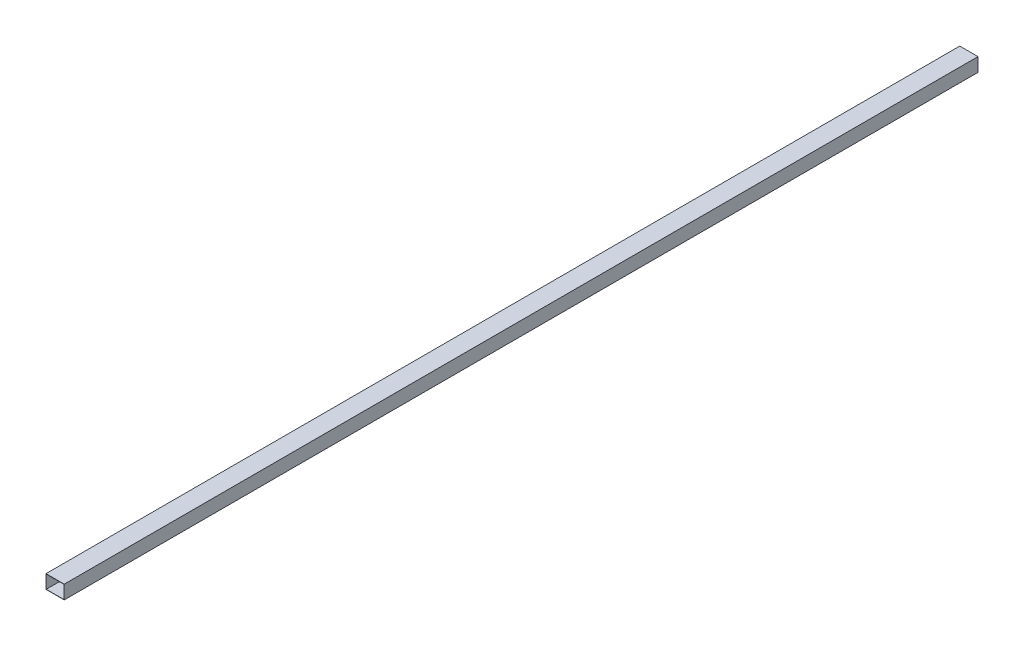
ISO-10303-21;
HEADER;
FILE_DESCRIPTION(('STEP AP214'),'2;1');
FILE_NAME('part.step','',(''),(''),'','','');
FILE_SCHEMA(('AUTOMOTIVE_DESIGN { 1 0 10303 214 1 1 1 1 }'));
ENDSEC;
DATA;
#1=APPLICATION_CONTEXT('core data for automotive mechanical design processes');
#2=APPLICATION_PROTOCOL_DEFINITION('international standard','automotive_design',2000,#1);
#3=PRODUCT_CONTEXT('',#1,'mechanical');
#4=PRODUCT('Part','Part','',(#3));
#5=PRODUCT_RELATED_PRODUCT_CATEGORY('part','',(#4));
#6=PRODUCT_DEFINITION_FORMATION('','',#4);
#7=PRODUCT_DEFINITION_CONTEXT('part definition',#1,'design');
#8=PRODUCT_DEFINITION('design','',#6,#7);
#9=PRODUCT_DEFINITION_SHAPE('','',#8);
#10=(LENGTH_UNIT() NAMED_UNIT(*) SI_UNIT(.MILLI.,.METRE.));
#11=(NAMED_UNIT(*) PLANE_ANGLE_UNIT() SI_UNIT($,.RADIAN.));
#12=(NAMED_UNIT(*) SI_UNIT($,.STERADIAN.) SOLID_ANGLE_UNIT());
#13=UNCERTAINTY_MEASURE_WITH_UNIT(LENGTH_MEASURE(1.E-05),#10,'distance_accuracy_value','');
#14=(GEOMETRIC_REPRESENTATION_CONTEXT(3) GLOBAL_UNCERTAINTY_ASSIGNED_CONTEXT((#13)) GLOBAL_UNIT_ASSIGNED_CONTEXT((#10,
#11,#12)) REPRESENTATION_CONTEXT('',''));
#15=CARTESIAN_POINT('',(0.,0.,0.));
#16=DIRECTION('',(0.,0.,1.));
#17=DIRECTION('',(1.,0.,0.));
#18=AXIS2_PLACEMENT_3D('',#15,#16,#17);
#19=CARTESIAN_POINT('',(0.,0.,2004.));
#20=DIRECTION('',(0.,0.,1.));
#21=DIRECTION('',(1.,0.,0.));
#22=AXIS2_PLACEMENT_3D('',#19,#20,#21);
#23=PLANE('',#22);
#24=DIRECTION('',(0.,1.,0.));
#25=VECTOR('',#24,1.);
#26=CARTESIAN_POINT('',(20.,15.,2004.));
#27=LINE('',#26,#25);
#28=CARTESIAN_POINT('',(20.,-15.,2004.));
#29=VERTEX_POINT('',#28);
#30=CARTESIAN_POINT('',(20.,15.,2004.));
#31=VERTEX_POINT('',#30);
#32=EDGE_CURVE('E134',#29,#31,#27,.T.);
#33=ORIENTED_EDGE('',*,*,#32,.T.);
#34=DIRECTION('',(-1.,0.,0.));
#35=VECTOR('',#34,1.);
#36=CARTESIAN_POINT('',(-20.,15.,2004.));
#37=LINE('',#36,#35);
#38=CARTESIAN_POINT('',(-20.,15.,2004.));
#39=VERTEX_POINT('',#38);
#40=EDGE_CURVE('E137',#31,#39,#37,.T.);
#41=ORIENTED_EDGE('',*,*,#40,.T.);
#42=DIRECTION('',(0.,-1.,0.));
#43=VECTOR('',#42,1.);
#44=CARTESIAN_POINT('',(-20.,15.,2004.));
#45=LINE('',#44,#43);
#46=CARTESIAN_POINT('',(-20.,-15.,2004.));
#47=VERTEX_POINT('',#46);
#48=EDGE_CURVE('E140',#39,#47,#45,.T.);
#49=ORIENTED_EDGE('',*,*,#48,.T.);
#50=DIRECTION('',(1.,0.,0.));
#51=VECTOR('',#50,1.);
#52=CARTESIAN_POINT('',(-20.,-15.,2004.));
#53=LINE('',#52,#51);
#54=EDGE_CURVE('E142',#47,#29,#53,.T.);
#55=ORIENTED_EDGE('',*,*,#54,.T.);
#56=EDGE_LOOP('',(#33,#41,#49,#55));
#57=FACE_BOUND('',#56,.T.);
#58=DIRECTION('',(-1.,0.,0.));
#59=VECTOR('',#58,1.);
#60=CARTESIAN_POINT('',(-19.5,14.5,2004.));
#61=LINE('',#60,#59);
#62=CARTESIAN_POINT('',(19.5,14.5,2004.));
#63=VERTEX_POINT('',#62);
#64=CARTESIAN_POINT('',(-19.5,14.5,2004.));
#65=VERTEX_POINT('',#64);
#66=EDGE_CURVE('E106',#63,#65,#61,.T.);
#67=ORIENTED_EDGE('',*,*,#66,.F.);
#68=DIRECTION('',(0.,1.,0.));
#69=VECTOR('',#68,1.);
#70=CARTESIAN_POINT('',(19.5,-14.5,2004.));
#71=LINE('',#70,#69);
#72=CARTESIAN_POINT('',(19.5,-14.5,2004.));
#73=VERTEX_POINT('',#72);
#74=EDGE_CURVE('E98',#73,#63,#71,.T.);
#75=ORIENTED_EDGE('',*,*,#74,.F.);
#76=DIRECTION('',(1.,0.,0.));
#77=VECTOR('',#76,1.);
#78=CARTESIAN_POINT('',(-19.5,-14.5,2004.));
#79=LINE('',#78,#77);
#80=CARTESIAN_POINT('',(-19.5,-14.5,2004.));
#81=VERTEX_POINT('',#80);
#82=EDGE_CURVE('E120',#81,#73,#79,.T.);
#83=ORIENTED_EDGE('',*,*,#82,.F.);
#84=DIRECTION('',(0.,-1.,0.));
#85=VECTOR('',#84,1.);
#86=CARTESIAN_POINT('',(-19.5,-14.5,2004.));
#87=LINE('',#86,#85);
#88=EDGE_CURVE('E118',#65,#81,#87,.T.);
#89=ORIENTED_EDGE('',*,*,#88,.F.);
#90=EDGE_LOOP('',(#67,#75,#83,#89));
#91=FACE_BOUND('',#90,.T.);
#92=ADVANCED_FACE('F33',(#57,#91),#23,.T.);
#93=CARTESIAN_POINT('',(0.,0.,0.));
#94=DIRECTION('',(0.,0.,1.));
#95=DIRECTION('',(1.,0.,0.));
#96=AXIS2_PLACEMENT_3D('',#93,#94,#95);
#97=PLANE('',#96);
#98=DIRECTION('',(0.,1.,0.));
#99=VECTOR('',#98,1.);
#100=CARTESIAN_POINT('',(20.,15.,0.));
#101=LINE('',#100,#99);
#102=CARTESIAN_POINT('',(20.,-15.,0.));
#103=VERTEX_POINT('',#102);
#104=CARTESIAN_POINT('',(20.,15.,0.));
#105=VERTEX_POINT('',#104);
#106=EDGE_CURVE('E114',#103,#105,#101,.T.);
#107=ORIENTED_EDGE('',*,*,#106,.F.);
#108=DIRECTION('',(1.,0.,0.));
#109=VECTOR('',#108,1.);
#110=CARTESIAN_POINT('',(-20.,-15.,0.));
#111=LINE('',#110,#109);
#112=CARTESIAN_POINT('',(-20.,-15.,0.));
#113=VERTEX_POINT('',#112);
#114=EDGE_CURVE('E138',#113,#103,#111,.T.);
#115=ORIENTED_EDGE('',*,*,#114,.F.);
#116=DIRECTION('',(0.,-1.,0.));
#117=VECTOR('',#116,1.);
#118=CARTESIAN_POINT('',(-20.,15.,0.));
#119=LINE('',#118,#117);
#120=CARTESIAN_POINT('',(-20.,15.,0.));
#121=VERTEX_POINT('',#120);
#122=EDGE_CURVE('E149',#121,#113,#119,.T.);
#123=ORIENTED_EDGE('',*,*,#122,.F.);
#124=DIRECTION('',(-1.,0.,0.));
#125=VECTOR('',#124,1.);
#126=CARTESIAN_POINT('',(-20.,15.,0.));
#127=LINE('',#126,#125);
#128=EDGE_CURVE('E147',#105,#121,#127,.T.);
#129=ORIENTED_EDGE('',*,*,#128,.F.);
#130=EDGE_LOOP('',(#107,#115,#123,#129));
#131=FACE_BOUND('',#130,.T.);
#132=DIRECTION('',(0.,1.,0.));
#133=VECTOR('',#132,1.);
#134=CARTESIAN_POINT('',(19.5,-14.5,0.));
#135=LINE('',#134,#133);
#136=CARTESIAN_POINT('',(19.5,-14.5,0.));
#137=VERTEX_POINT('',#136);
#138=CARTESIAN_POINT('',(19.5,14.5,0.));
#139=VERTEX_POINT('',#138);
#140=EDGE_CURVE('E56',#137,#139,#135,.T.);
#141=ORIENTED_EDGE('',*,*,#140,.T.);
#142=DIRECTION('',(-1.,0.,0.));
#143=VECTOR('',#142,1.);
#144=CARTESIAN_POINT('',(-19.5,14.5,0.));
#145=LINE('',#144,#143);
#146=CARTESIAN_POINT('',(-19.5,14.5,0.));
#147=VERTEX_POINT('',#146);
#148=EDGE_CURVE('E113',#139,#147,#145,.T.);
#149=ORIENTED_EDGE('',*,*,#148,.T.);
#150=DIRECTION('',(0.,-1.,0.));
#151=VECTOR('',#150,1.);
#152=CARTESIAN_POINT('',(-19.5,-14.5,0.));
#153=LINE('',#152,#151);
#154=CARTESIAN_POINT('',(-19.5,-14.5,0.));
#155=VERTEX_POINT('',#154);
#156=EDGE_CURVE('E126',#147,#155,#153,.T.);
#157=ORIENTED_EDGE('',*,*,#156,.T.);
#158=DIRECTION('',(1.,0.,0.));
#159=VECTOR('',#158,1.);
#160=CARTESIAN_POINT('',(-19.5,-14.5,0.));
#161=LINE('',#160,#159);
#162=EDGE_CURVE('E107',#155,#137,#161,.T.);
#163=ORIENTED_EDGE('',*,*,#162,.T.);
#164=EDGE_LOOP('',(#141,#149,#157,#163));
#165=FACE_BOUND('',#164,.T.);
#166=ADVANCED_FACE('F167',(#131,#165),#97,.F.);
#167=CARTESIAN_POINT('',(20.,15.,2004.));
#168=DIRECTION('',(-1.,0.,0.));
#169=DIRECTION('',(0.,-1.,0.));
#170=AXIS2_PLACEMENT_3D('',#167,#168,#169);
#171=PLANE('',#170);
#172=ORIENTED_EDGE('',*,*,#106,.T.);
#173=DIRECTION('',(0.,0.,-1.));
#174=VECTOR('',#173,1.);
#175=CARTESIAN_POINT('',(20.,15.,2004.));
#176=LINE('',#175,#174);
#177=EDGE_CURVE('E11',#31,#105,#176,.T.);
#178=ORIENTED_EDGE('',*,*,#177,.F.);
#179=ORIENTED_EDGE('',*,*,#32,.F.);
#180=DIRECTION('',(0.,0.,-1.));
#181=VECTOR('',#180,1.);
#182=CARTESIAN_POINT('',(20.,-15.,2004.));
#183=LINE('',#182,#181);
#184=EDGE_CURVE('E144',#29,#103,#183,.T.);
#185=ORIENTED_EDGE('',*,*,#184,.T.);
#186=EDGE_LOOP('',(#172,#178,#179,#185));
#187=FACE_BOUND('',#186,.T.);
#188=ADVANCED_FACE('F35',(#187),#171,.F.);
#189=CARTESIAN_POINT('',(-20.,15.,2004.));
#190=DIRECTION('',(0.,-1.,0.));
#191=DIRECTION('',(0.,0.,-1.));
#192=AXIS2_PLACEMENT_3D('',#189,#190,#191);
#193=PLANE('',#192);
#194=ORIENTED_EDGE('',*,*,#128,.T.);
#195=DIRECTION('',(0.,0.,-1.));
#196=VECTOR('',#195,1.);
#197=CARTESIAN_POINT('',(-20.,15.,2004.));
#198=LINE('',#197,#196);
#199=EDGE_CURVE('E41',#39,#121,#198,.T.);
#200=ORIENTED_EDGE('',*,*,#199,.F.);
#201=ORIENTED_EDGE('',*,*,#40,.F.);
#202=ORIENTED_EDGE('',*,*,#177,.T.);
#203=EDGE_LOOP('',(#194,#200,#201,#202));
#204=FACE_BOUND('',#203,.T.);
#205=ADVANCED_FACE('F177',(#204),#193,.F.);
#206=CARTESIAN_POINT('',(-20.,15.,2004.));
#207=DIRECTION('',(1.,0.,0.));
#208=DIRECTION('',(0.,1.,0.));
#209=AXIS2_PLACEMENT_3D('',#206,#207,#208);
#210=PLANE('',#209);
#211=ORIENTED_EDGE('',*,*,#122,.T.);
#212=DIRECTION('',(0.,0.,-1.));
#213=VECTOR('',#212,1.);
#214=CARTESIAN_POINT('',(-20.,-15.,2004.));
#215=LINE('',#214,#213);
#216=EDGE_CURVE('E154',#47,#113,#215,.T.);
#217=ORIENTED_EDGE('',*,*,#216,.F.);
#218=ORIENTED_EDGE('',*,*,#48,.F.);
#219=ORIENTED_EDGE('',*,*,#199,.T.);
#220=EDGE_LOOP('',(#211,#217,#218,#219));
#221=FACE_BOUND('',#220,.T.);
#222=ADVANCED_FACE('F161',(#221),#210,.F.);
#223=CARTESIAN_POINT('',(-20.,-15.,2004.));
#224=DIRECTION('',(0.,1.,0.));
#225=DIRECTION('',(0.,0.,1.));
#226=AXIS2_PLACEMENT_3D('',#223,#224,#225);
#227=PLANE('',#226);
#228=ORIENTED_EDGE('',*,*,#114,.T.);
#229=ORIENTED_EDGE('',*,*,#184,.F.);
#230=ORIENTED_EDGE('',*,*,#54,.F.);
#231=ORIENTED_EDGE('',*,*,#216,.T.);
#232=EDGE_LOOP('',(#228,#229,#230,#231));
#233=FACE_BOUND('',#232,.T.);
#234=ADVANCED_FACE('F171',(#233),#227,.F.);
#235=CARTESIAN_POINT('',(19.5,-14.5,2004.));
#236=DIRECTION('',(-1.,0.,0.));
#237=DIRECTION('',(0.,0.,1.));
#238=AXIS2_PLACEMENT_3D('',#235,#236,#237);
#239=PLANE('',#238);
#240=ORIENTED_EDGE('',*,*,#140,.F.);
#241=DIRECTION('',(0.,0.,-1.));
#242=VECTOR('',#241,1.);
#243=CARTESIAN_POINT('',(19.5,-14.5,2004.));
#244=LINE('',#243,#242);
#245=EDGE_CURVE('E102',#73,#137,#244,.T.);
#246=ORIENTED_EDGE('',*,*,#245,.F.);
#247=ORIENTED_EDGE('',*,*,#74,.T.);
#248=DIRECTION('',(0.,0.,-1.));
#249=VECTOR('',#248,1.);
#250=CARTESIAN_POINT('',(19.5,14.5,2004.));
#251=LINE('',#250,#249);
#252=EDGE_CURVE('E101',#63,#139,#251,.T.);
#253=ORIENTED_EDGE('',*,*,#252,.T.);
#254=EDGE_LOOP('',(#240,#246,#247,#253));
#255=FACE_BOUND('',#254,.T.);
#256=ADVANCED_FACE('F100',(#255),#239,.T.);
#257=CARTESIAN_POINT('',(-19.5,14.5,2004.));
#258=DIRECTION('',(0.,-1.,0.));
#259=DIRECTION('',(0.,0.,-1.));
#260=AXIS2_PLACEMENT_3D('',#257,#258,#259);
#261=PLANE('',#260);
#262=ORIENTED_EDGE('',*,*,#148,.F.);
#263=ORIENTED_EDGE('',*,*,#252,.F.);
#264=ORIENTED_EDGE('',*,*,#66,.T.);
#265=DIRECTION('',(0.,0.,-1.));
#266=VECTOR('',#265,1.);
#267=CARTESIAN_POINT('',(-19.5,14.5,2004.));
#268=LINE('',#267,#266);
#269=EDGE_CURVE('E115',#65,#147,#268,.T.);
#270=ORIENTED_EDGE('',*,*,#269,.T.);
#271=EDGE_LOOP('',(#262,#263,#264,#270));
#272=FACE_BOUND('',#271,.T.);
#273=ADVANCED_FACE('F110',(#272),#261,.T.);
#274=CARTESIAN_POINT('',(-19.5,-14.5,2004.));
#275=DIRECTION('',(1.,0.,0.));
#276=DIRECTION('',(0.,0.,-1.));
#277=AXIS2_PLACEMENT_3D('',#274,#275,#276);
#278=PLANE('',#277);
#279=ORIENTED_EDGE('',*,*,#156,.F.);
#280=ORIENTED_EDGE('',*,*,#269,.F.);
#281=ORIENTED_EDGE('',*,*,#88,.T.);
#282=DIRECTION('',(0.,0.,-1.));
#283=VECTOR('',#282,1.);
#284=CARTESIAN_POINT('',(-19.5,-14.5,2004.));
#285=LINE('',#284,#283);
#286=EDGE_CURVE('E48',#81,#155,#285,.T.);
#287=ORIENTED_EDGE('',*,*,#286,.T.);
#288=EDGE_LOOP('',(#279,#280,#281,#287));
#289=FACE_BOUND('',#288,.T.);
#290=ADVANCED_FACE('F200',(#289),#278,.T.);
#291=CARTESIAN_POINT('',(-19.5,-14.5,2004.));
#292=DIRECTION('',(0.,1.,0.));
#293=DIRECTION('',(0.,0.,1.));
#294=AXIS2_PLACEMENT_3D('',#291,#292,#293);
#295=PLANE('',#294);
#296=ORIENTED_EDGE('',*,*,#162,.F.);
#297=ORIENTED_EDGE('',*,*,#286,.F.);
#298=ORIENTED_EDGE('',*,*,#82,.T.);
#299=ORIENTED_EDGE('',*,*,#245,.T.);
#300=EDGE_LOOP('',(#296,#297,#298,#299));
#301=FACE_BOUND('',#300,.T.);
#302=ADVANCED_FACE('F204',(#301),#295,.T.);
#303=CLOSED_SHELL('',(#92,#166,#188,#205,#222,#234,#256,#273,#290,#302));
#304=MANIFOLD_SOLID_BREP('B2',#303);
#305=ADVANCED_BREP_SHAPE_REPRESENTATION('',(#18,#304),#14);
#306=SHAPE_DEFINITION_REPRESENTATION(#9,#305);
ENDSEC;
END-ISO-10303-21;
